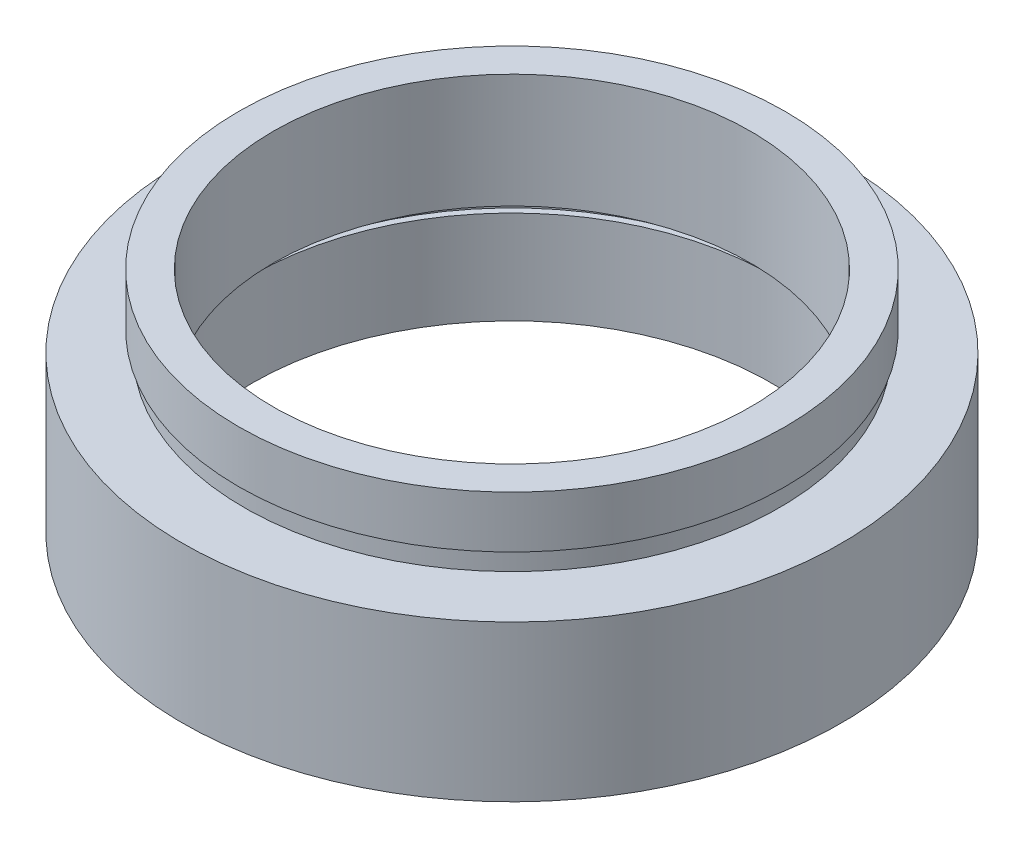
ISO-10303-21;
HEADER;
FILE_DESCRIPTION(('STEP AP214'),'2;1');
FILE_NAME('part.step','',(''),(''),'','','');
FILE_SCHEMA(('AUTOMOTIVE_DESIGN { 1 0 10303 214 1 1 1 1 }'));
ENDSEC;
DATA;
#1=APPLICATION_CONTEXT('core data for automotive mechanical design processes');
#2=APPLICATION_PROTOCOL_DEFINITION('international standard','automotive_design',2000,#1);
#3=PRODUCT_CONTEXT('',#1,'mechanical');
#4=PRODUCT('Part','Part','',(#3));
#5=PRODUCT_RELATED_PRODUCT_CATEGORY('part','',(#4));
#6=PRODUCT_DEFINITION_FORMATION('','',#4);
#7=PRODUCT_DEFINITION_CONTEXT('part definition',#1,'design');
#8=PRODUCT_DEFINITION('design','',#6,#7);
#9=PRODUCT_DEFINITION_SHAPE('','',#8);
#10=(LENGTH_UNIT() NAMED_UNIT(*) SI_UNIT(.MILLI.,.METRE.));
#11=(NAMED_UNIT(*) PLANE_ANGLE_UNIT() SI_UNIT($,.RADIAN.));
#12=(NAMED_UNIT(*) SI_UNIT($,.STERADIAN.) SOLID_ANGLE_UNIT());
#13=UNCERTAINTY_MEASURE_WITH_UNIT(LENGTH_MEASURE(1.E-05),#10,'distance_accuracy_value','');
#14=(GEOMETRIC_REPRESENTATION_CONTEXT(3) GLOBAL_UNCERTAINTY_ASSIGNED_CONTEXT((#13)) GLOBAL_UNIT_ASSIGNED_CONTEXT((#10,
#11,#12)) REPRESENTATION_CONTEXT('',''));
#15=CARTESIAN_POINT('',(0.,0.,0.));
#16=DIRECTION('',(0.,0.,1.));
#17=DIRECTION('',(1.,0.,0.));
#18=AXIS2_PLACEMENT_3D('',#15,#16,#17);
#19=CARTESIAN_POINT('',(15.875,0.,0.));
#20=DIRECTION('',(0.,1.,0.));
#21=DIRECTION('',(-1.,0.,0.));
#22=AXIS2_PLACEMENT_3D('',#19,#20,#21);
#23=PLANE('',#22);
#24=CARTESIAN_POINT('',(0.,0.,0.));
#25=DIRECTION('',(0.,1.,0.));
#26=DIRECTION('',(-1.,0.,0.));
#27=AXIS2_PLACEMENT_3D('',#24,#25,#26);
#28=CIRCLE('',#27,15.875);
#29=CARTESIAN_POINT('',(-15.875,0.,0.));
#30=VERTEX_POINT('',#29);
#31=EDGE_CURVE('E77',#30,#30,#28,.T.);
#32=ORIENTED_EDGE('',*,*,#31,.F.);
#33=EDGE_LOOP('',(#32));
#34=FACE_BOUND('',#33,.T.);
#35=CARTESIAN_POINT('',(0.,0.,0.));
#36=DIRECTION('',(0.,1.,0.));
#37=DIRECTION('',(-1.,0.,0.));
#38=AXIS2_PLACEMENT_3D('',#35,#36,#37);
#39=CIRCLE('',#38,12.5);
#40=CARTESIAN_POINT('',(-12.5,0.,0.));
#41=VERTEX_POINT('',#40);
#42=EDGE_CURVE('E10',#41,#41,#39,.T.);
#43=ORIENTED_EDGE('',*,*,#42,.T.);
#44=EDGE_LOOP('',(#43));
#45=FACE_BOUND('',#44,.T.);
#46=ADVANCED_FACE('F37',(#34,#45),#23,.F.);
#47=CARTESIAN_POINT('',(0.,16.8860182370821,0.));
#48=DIRECTION('',(0.,1.,0.));
#49=DIRECTION('',(-1.,0.,0.));
#50=AXIS2_PLACEMENT_3D('',#47,#48,#49);
#51=CYLINDRICAL_SURFACE('',#50,12.5);
#52=ORIENTED_EDGE('',*,*,#42,.F.);
#53=EDGE_LOOP('',(#52));
#54=FACE_BOUND('',#53,.T.);
#55=CARTESIAN_POINT('',(0.,4.5,0.));
#56=DIRECTION('',(0.,1.,0.));
#57=DIRECTION('',(-1.,0.,0.));
#58=AXIS2_PLACEMENT_3D('',#55,#56,#57);
#59=CIRCLE('',#58,12.5);
#60=CARTESIAN_POINT('',(-12.5,4.5,0.));
#61=VERTEX_POINT('',#60);
#62=EDGE_CURVE('E43',#61,#61,#59,.T.);
#63=ORIENTED_EDGE('',*,*,#62,.T.);
#64=EDGE_LOOP('',(#63));
#65=FACE_BOUND('',#64,.T.);
#66=ADVANCED_FACE('F84',(#54,#65),#51,.F.);
#67=CARTESIAN_POINT('',(12.5,4.5,0.));
#68=DIRECTION('',(0.,-1.,0.));
#69=DIRECTION('',(1.,0.,0.));
#70=AXIS2_PLACEMENT_3D('',#67,#68,#69);
#71=PLANE('',#70);
#72=ORIENTED_EDGE('',*,*,#62,.F.);
#73=EDGE_LOOP('',(#72));
#74=FACE_BOUND('',#73,.T.);
#75=CARTESIAN_POINT('',(0.,4.5,0.));
#76=DIRECTION('',(0.,1.,0.));
#77=DIRECTION('',(-1.,0.,0.));
#78=AXIS2_PLACEMENT_3D('',#75,#76,#77);
#79=CIRCLE('',#78,12.8);
#80=CARTESIAN_POINT('',(-12.8,4.5,0.));
#81=VERTEX_POINT('',#80);
#82=EDGE_CURVE('E47',#81,#81,#79,.T.);
#83=ORIENTED_EDGE('',*,*,#82,.T.);
#84=EDGE_LOOP('',(#83));
#85=FACE_BOUND('',#84,.T.);
#86=ADVANCED_FACE('F88',(#74,#85),#71,.F.);
#87=CARTESIAN_POINT('',(0.,16.8860182370821,0.));
#88=DIRECTION('',(0.,1.,0.));
#89=DIRECTION('',(-1.,0.,0.));
#90=AXIS2_PLACEMENT_3D('',#87,#88,#89);
#91=CYLINDRICAL_SURFACE('',#90,12.8);
#92=ORIENTED_EDGE('',*,*,#82,.F.);
#93=EDGE_LOOP('',(#92));
#94=FACE_BOUND('',#93,.T.);
#95=CARTESIAN_POINT('',(0.,5.5,0.));
#96=DIRECTION('',(0.,1.,0.));
#97=DIRECTION('',(-1.,0.,0.));
#98=AXIS2_PLACEMENT_3D('',#95,#96,#97);
#99=CIRCLE('',#98,12.8);
#100=CARTESIAN_POINT('',(-12.8,5.5,0.));
#101=VERTEX_POINT('',#100);
#102=EDGE_CURVE('E51',#101,#101,#99,.T.);
#103=ORIENTED_EDGE('',*,*,#102,.T.);
#104=EDGE_LOOP('',(#103));
#105=FACE_BOUND('',#104,.T.);
#106=ADVANCED_FACE('F93',(#94,#105),#91,.F.);
#107=CARTESIAN_POINT('',(11.5,5.5,0.));
#108=DIRECTION('',(0.,1.,0.));
#109=DIRECTION('',(-1.,0.,0.));
#110=AXIS2_PLACEMENT_3D('',#107,#108,#109);
#111=PLANE('',#110);
#112=ORIENTED_EDGE('',*,*,#102,.F.);
#113=EDGE_LOOP('',(#112));
#114=FACE_BOUND('',#113,.T.);
#115=CARTESIAN_POINT('',(0.,5.5,0.));
#116=DIRECTION('',(0.,1.,0.));
#117=DIRECTION('',(-1.,0.,0.));
#118=AXIS2_PLACEMENT_3D('',#115,#116,#117);
#119=CIRCLE('',#118,11.5);
#120=CARTESIAN_POINT('',(-11.5,5.5,0.));
#121=VERTEX_POINT('',#120);
#122=EDGE_CURVE('E56',#121,#121,#119,.T.);
#123=ORIENTED_EDGE('',*,*,#122,.T.);
#124=EDGE_LOOP('',(#123));
#125=FACE_BOUND('',#124,.T.);
#126=ADVANCED_FACE('F99',(#114,#125),#111,.F.);
#127=CARTESIAN_POINT('',(0.,16.8860182370821,0.));
#128=DIRECTION('',(0.,1.,0.));
#129=DIRECTION('',(-1.,0.,0.));
#130=AXIS2_PLACEMENT_3D('',#127,#128,#129);
#131=CYLINDRICAL_SURFACE('',#130,11.5);
#132=ORIENTED_EDGE('',*,*,#122,.F.);
#133=EDGE_LOOP('',(#132));
#134=FACE_BOUND('',#133,.T.);
#135=CARTESIAN_POINT('',(0.,11.,0.));
#136=DIRECTION('',(0.,1.,0.));
#137=DIRECTION('',(-1.,0.,0.));
#138=AXIS2_PLACEMENT_3D('',#135,#136,#137);
#139=CIRCLE('',#138,11.5);
#140=CARTESIAN_POINT('',(-11.5,11.,0.));
#141=VERTEX_POINT('',#140);
#142=EDGE_CURVE('E59',#141,#141,#139,.T.);
#143=ORIENTED_EDGE('',*,*,#142,.T.);
#144=EDGE_LOOP('',(#143));
#145=FACE_BOUND('',#144,.T.);
#146=ADVANCED_FACE('F103',(#134,#145),#131,.F.);
#147=CARTESIAN_POINT('',(11.5,11.,0.));
#148=DIRECTION('',(0.,-1.,0.));
#149=DIRECTION('',(1.,0.,0.));
#150=AXIS2_PLACEMENT_3D('',#147,#148,#149);
#151=PLANE('',#150);
#152=ORIENTED_EDGE('',*,*,#142,.F.);
#153=EDGE_LOOP('',(#152));
#154=FACE_BOUND('',#153,.T.);
#155=CARTESIAN_POINT('',(0.,11.,0.));
#156=DIRECTION('',(0.,1.,0.));
#157=DIRECTION('',(-1.,0.,0.));
#158=AXIS2_PLACEMENT_3D('',#155,#156,#157);
#159=CIRCLE('',#158,13.16);
#160=CARTESIAN_POINT('',(-13.16,11.,0.));
#161=VERTEX_POINT('',#160);
#162=EDGE_CURVE('E62',#161,#161,#159,.T.);
#163=ORIENTED_EDGE('',*,*,#162,.T.);
#164=EDGE_LOOP('',(#163));
#165=FACE_BOUND('',#164,.T.);
#166=ADVANCED_FACE('F107',(#154,#165),#151,.F.);
#167=CARTESIAN_POINT('',(0.,16.8860182370821,0.));
#168=DIRECTION('',(0.,1.,0.));
#169=DIRECTION('',(-1.,0.,0.));
#170=AXIS2_PLACEMENT_3D('',#167,#168,#169);
#171=CYLINDRICAL_SURFACE('',#170,13.16);
#172=ORIENTED_EDGE('',*,*,#162,.F.);
#173=EDGE_LOOP('',(#172));
#174=FACE_BOUND('',#173,.T.);
#175=CARTESIAN_POINT('',(0.,8.5,0.));
#176=DIRECTION('',(0.,1.,0.));
#177=DIRECTION('',(-1.,0.,0.));
#178=AXIS2_PLACEMENT_3D('',#175,#176,#177);
#179=CIRCLE('',#178,13.16);
#180=CARTESIAN_POINT('',(-13.16,8.5,0.));
#181=VERTEX_POINT('',#180);
#182=EDGE_CURVE('E65',#181,#181,#179,.T.);
#183=ORIENTED_EDGE('',*,*,#182,.T.);
#184=EDGE_LOOP('',(#183));
#185=FACE_BOUND('',#184,.T.);
#186=ADVANCED_FACE('F111',(#174,#185),#171,.T.);
#187=CARTESIAN_POINT('',(13.16,8.5,0.));
#188=DIRECTION('',(0.,1.,0.));
#189=DIRECTION('',(-1.,0.,0.));
#190=AXIS2_PLACEMENT_3D('',#187,#188,#189);
#191=PLANE('',#190);
#192=ORIENTED_EDGE('',*,*,#182,.F.);
#193=EDGE_LOOP('',(#192));
#194=FACE_BOUND('',#193,.T.);
#195=CARTESIAN_POINT('',(0.,8.5,0.));
#196=DIRECTION('',(0.,1.,0.));
#197=DIRECTION('',(-1.,0.,0.));
#198=AXIS2_PLACEMENT_3D('',#195,#196,#197);
#199=CIRCLE('',#198,12.9);
#200=CARTESIAN_POINT('',(-12.9,8.5,0.));
#201=VERTEX_POINT('',#200);
#202=EDGE_CURVE('E68',#201,#201,#199,.T.);
#203=ORIENTED_EDGE('',*,*,#202,.T.);
#204=EDGE_LOOP('',(#203));
#205=FACE_BOUND('',#204,.T.);
#206=ADVANCED_FACE('F115',(#194,#205),#191,.F.);
#207=CARTESIAN_POINT('',(0.,16.8860182370821,0.));
#208=DIRECTION('',(0.,1.,0.));
#209=DIRECTION('',(-1.,0.,0.));
#210=AXIS2_PLACEMENT_3D('',#207,#208,#209);
#211=CYLINDRICAL_SURFACE('',#210,12.9);
#212=ORIENTED_EDGE('',*,*,#202,.F.);
#213=EDGE_LOOP('',(#212));
#214=FACE_BOUND('',#213,.T.);
#215=CARTESIAN_POINT('',(0.,7.5,0.));
#216=DIRECTION('',(0.,1.,0.));
#217=DIRECTION('',(-1.,0.,0.));
#218=AXIS2_PLACEMENT_3D('',#215,#216,#217);
#219=CIRCLE('',#218,12.9);
#220=CARTESIAN_POINT('',(-12.9,7.5,0.));
#221=VERTEX_POINT('',#220);
#222=EDGE_CURVE('E71',#221,#221,#219,.T.);
#223=ORIENTED_EDGE('',*,*,#222,.T.);
#224=EDGE_LOOP('',(#223));
#225=FACE_BOUND('',#224,.T.);
#226=ADVANCED_FACE('F119',(#214,#225),#211,.T.);
#227=CARTESIAN_POINT('',(12.9,7.5,0.));
#228=DIRECTION('',(0.,-1.,0.));
#229=DIRECTION('',(1.,0.,0.));
#230=AXIS2_PLACEMENT_3D('',#227,#228,#229);
#231=PLANE('',#230);
#232=ORIENTED_EDGE('',*,*,#222,.F.);
#233=EDGE_LOOP('',(#232));
#234=FACE_BOUND('',#233,.T.);
#235=CARTESIAN_POINT('',(0.,7.5,0.));
#236=DIRECTION('',(0.,1.,0.));
#237=DIRECTION('',(-1.,0.,0.));
#238=AXIS2_PLACEMENT_3D('',#235,#236,#237);
#239=CIRCLE('',#238,15.875);
#240=CARTESIAN_POINT('',(-15.875,7.5,0.));
#241=VERTEX_POINT('',#240);
#242=EDGE_CURVE('E74',#241,#241,#239,.T.);
#243=ORIENTED_EDGE('',*,*,#242,.T.);
#244=EDGE_LOOP('',(#243));
#245=FACE_BOUND('',#244,.T.);
#246=ADVANCED_FACE('F123',(#234,#245),#231,.F.);
#247=CARTESIAN_POINT('',(0.,16.8860182370821,0.));
#248=DIRECTION('',(0.,1.,0.));
#249=DIRECTION('',(-1.,0.,0.));
#250=AXIS2_PLACEMENT_3D('',#247,#248,#249);
#251=CYLINDRICAL_SURFACE('',#250,15.875);
#252=ORIENTED_EDGE('',*,*,#242,.F.);
#253=EDGE_LOOP('',(#252));
#254=FACE_BOUND('',#253,.T.);
#255=ORIENTED_EDGE('',*,*,#31,.T.);
#256=EDGE_LOOP('',(#255));
#257=FACE_BOUND('',#256,.T.);
#258=ADVANCED_FACE('F81',(#254,#257),#251,.T.);
#259=CLOSED_SHELL('',(#46,#66,#86,#106,#126,#146,#166,#186,#206,#226,#246,#258));
#260=MANIFOLD_SOLID_BREP('B2',#259);
#261=ADVANCED_BREP_SHAPE_REPRESENTATION('',(#18,#260),#14);
#262=SHAPE_DEFINITION_REPRESENTATION(#9,#261);
ENDSEC;
END-ISO-10303-21;
